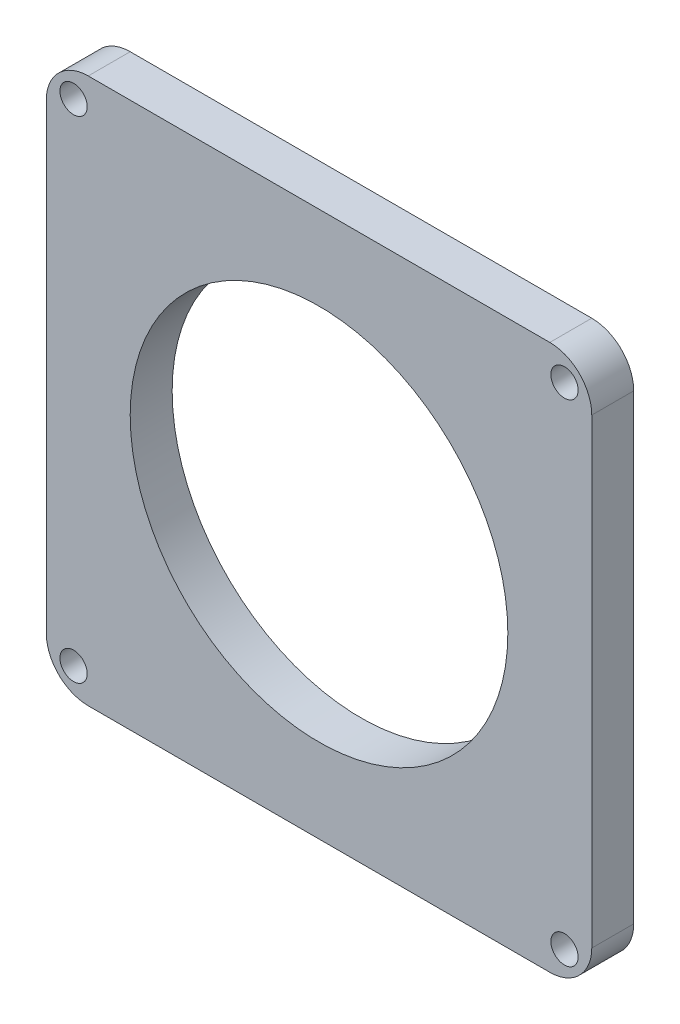
ISO-10303-21;
HEADER;
FILE_DESCRIPTION(('STEP AP214'),'2;1');
FILE_NAME('part.step','',(''),(''),'','','');
FILE_SCHEMA(('AUTOMOTIVE_DESIGN { 1 0 10303 214 1 1 1 1 }'));
ENDSEC;
DATA;
#1=APPLICATION_CONTEXT('core data for automotive mechanical design processes');
#2=APPLICATION_PROTOCOL_DEFINITION('international standard','automotive_design',2000,#1);
#3=PRODUCT_CONTEXT('',#1,'mechanical');
#4=PRODUCT('Part','Part','',(#3));
#5=PRODUCT_RELATED_PRODUCT_CATEGORY('part','',(#4));
#6=PRODUCT_DEFINITION_FORMATION('','',#4);
#7=PRODUCT_DEFINITION_CONTEXT('part definition',#1,'design');
#8=PRODUCT_DEFINITION('design','',#6,#7);
#9=PRODUCT_DEFINITION_SHAPE('','',#8);
#10=(LENGTH_UNIT() NAMED_UNIT(*) SI_UNIT(.MILLI.,.METRE.));
#11=(NAMED_UNIT(*) PLANE_ANGLE_UNIT() SI_UNIT($,.RADIAN.));
#12=(NAMED_UNIT(*) SI_UNIT($,.STERADIAN.) SOLID_ANGLE_UNIT());
#13=UNCERTAINTY_MEASURE_WITH_UNIT(LENGTH_MEASURE(1.E-05),#10,'distance_accuracy_value','');
#14=(GEOMETRIC_REPRESENTATION_CONTEXT(3) GLOBAL_UNCERTAINTY_ASSIGNED_CONTEXT((#13)) GLOBAL_UNIT_ASSIGNED_CONTEXT((#10,
#11,#12)) REPRESENTATION_CONTEXT('',''));
#15=CARTESIAN_POINT('',(0.,0.,0.));
#16=DIRECTION('',(0.,0.,1.));
#17=DIRECTION('',(1.,0.,0.));
#18=AXIS2_PLACEMENT_3D('',#15,#16,#17);
#19=CARTESIAN_POINT('',(-55.,-65.,10.));
#20=DIRECTION('',(0.,0.,1.));
#21=DIRECTION('',(1.,0.,0.));
#22=AXIS2_PLACEMENT_3D('',#19,#20,#21);
#23=PLANE('',#22);
#24=CARTESIAN_POINT('',(0.,0.,10.));
#25=DIRECTION('',(0.,0.,1.));
#26=DIRECTION('',(1.,0.,0.));
#27=AXIS2_PLACEMENT_3D('',#24,#25,#26);
#28=CIRCLE('',#27,45.);
#29=CARTESIAN_POINT('',(45.,0.,10.));
#30=VERTEX_POINT('',#29);
#31=EDGE_CURVE('E38',#30,#30,#28,.T.);
#32=ORIENTED_EDGE('',*,*,#31,.F.);
#33=EDGE_LOOP('',(#32));
#34=FACE_BOUND('',#33,.T.);
#35=CARTESIAN_POINT('',(-58.4999999999984,-58.5000000000001,10.));
#36=DIRECTION('',(0.,0.,1.));
#37=DIRECTION('',(1.,0.,0.));
#38=AXIS2_PLACEMENT_3D('',#35,#36,#37);
#39=CIRCLE('',#38,3.25000000000126);
#40=CARTESIAN_POINT('',(-55.2499999999971,-58.5000000000001,10.));
#41=VERTEX_POINT('',#40);
#42=EDGE_CURVE('E44',#41,#41,#39,.T.);
#43=ORIENTED_EDGE('',*,*,#42,.F.);
#44=EDGE_LOOP('',(#43));
#45=FACE_BOUND('',#44,.T.);
#46=CARTESIAN_POINT('',(58.5000000000017,-58.4999999999984,10.));
#47=DIRECTION('',(0.,0.,1.));
#48=DIRECTION('',(1.,0.,0.));
#49=AXIS2_PLACEMENT_3D('',#46,#47,#48);
#50=CIRCLE('',#49,3.25000000000256);
#51=CARTESIAN_POINT('',(61.7500000000042,-58.4999999999984,10.));
#52=VERTEX_POINT('',#51);
#53=EDGE_CURVE('E161',#52,#52,#50,.T.);
#54=ORIENTED_EDGE('',*,*,#53,.F.);
#55=EDGE_LOOP('',(#54));
#56=FACE_BOUND('',#55,.T.);
#57=CARTESIAN_POINT('',(58.5,58.5000000000016,10.));
#58=DIRECTION('',(0.,0.,1.));
#59=DIRECTION('',(1.,0.,0.));
#60=AXIS2_PLACEMENT_3D('',#57,#58,#59);
#61=CIRCLE('',#60,3.2500000000018);
#62=CARTESIAN_POINT('',(61.7500000000018,58.5000000000016,10.));
#63=VERTEX_POINT('',#62);
#64=EDGE_CURVE('E157',#63,#63,#61,.T.);
#65=ORIENTED_EDGE('',*,*,#64,.F.);
#66=EDGE_LOOP('',(#65));
#67=FACE_BOUND('',#66,.T.);
#68=CARTESIAN_POINT('',(-58.5,58.5,10.));
#69=DIRECTION('',(0.,0.,1.));
#70=DIRECTION('',(1.,0.,0.));
#71=AXIS2_PLACEMENT_3D('',#68,#69,#70);
#72=CIRCLE('',#71,3.25);
#73=CARTESIAN_POINT('',(-55.25,58.5,10.));
#74=VERTEX_POINT('',#73);
#75=EDGE_CURVE('E154',#74,#74,#72,.T.);
#76=ORIENTED_EDGE('',*,*,#75,.F.);
#77=EDGE_LOOP('',(#76));
#78=FACE_BOUND('',#77,.T.);
#79=CARTESIAN_POINT('',(-55.,-55.,10.));
#80=DIRECTION('',(0.,0.,1.));
#81=DIRECTION('',(1.,0.,0.));
#82=AXIS2_PLACEMENT_3D('',#79,#80,#81);
#83=CIRCLE('',#82,9.99999999999998);
#84=CARTESIAN_POINT('',(-65.,-55.,10.));
#85=VERTEX_POINT('',#84);
#86=CARTESIAN_POINT('',(-55.,-65.,10.));
#87=VERTEX_POINT('',#86);
#88=EDGE_CURVE('E152',#85,#87,#83,.T.);
#89=ORIENTED_EDGE('',*,*,#88,.T.);
#90=DIRECTION('',(1.,0.,0.));
#91=VECTOR('',#90,1.);
#92=CARTESIAN_POINT('',(-55.,-65.,10.));
#93=LINE('',#92,#91);
#94=CARTESIAN_POINT('',(55.,-65.,10.));
#95=VERTEX_POINT('',#94);
#96=EDGE_CURVE('E80',#87,#95,#93,.T.);
#97=ORIENTED_EDGE('',*,*,#96,.T.);
#98=CARTESIAN_POINT('',(55.,-55.,10.));
#99=DIRECTION('',(0.,0.,1.));
#100=DIRECTION('',(1.,0.,0.));
#101=AXIS2_PLACEMENT_3D('',#98,#99,#100);
#102=CIRCLE('',#101,10.);
#103=CARTESIAN_POINT('',(65.,-55.,10.));
#104=VERTEX_POINT('',#103);
#105=EDGE_CURVE('E149',#95,#104,#102,.T.);
#106=ORIENTED_EDGE('',*,*,#105,.T.);
#107=DIRECTION('',(0.,1.,0.));
#108=VECTOR('',#107,1.);
#109=CARTESIAN_POINT('',(65.,55.,10.));
#110=LINE('',#109,#108);
#111=CARTESIAN_POINT('',(65.,55.,10.));
#112=VERTEX_POINT('',#111);
#113=EDGE_CURVE('E122',#104,#112,#110,.T.);
#114=ORIENTED_EDGE('',*,*,#113,.T.);
#115=CARTESIAN_POINT('',(55.,55.,10.));
#116=DIRECTION('',(0.,0.,1.));
#117=DIRECTION('',(-1.,0.,0.));
#118=AXIS2_PLACEMENT_3D('',#115,#116,#117);
#119=CIRCLE('',#118,10.);
#120=CARTESIAN_POINT('',(55.,65.,10.));
#121=VERTEX_POINT('',#120);
#122=EDGE_CURVE('E146',#112,#121,#119,.T.);
#123=ORIENTED_EDGE('',*,*,#122,.T.);
#124=DIRECTION('',(-1.,0.,0.));
#125=VECTOR('',#124,1.);
#126=CARTESIAN_POINT('',(-55.,65.,10.));
#127=LINE('',#126,#125);
#128=CARTESIAN_POINT('',(-55.,65.,10.));
#129=VERTEX_POINT('',#128);
#130=EDGE_CURVE('E144',#121,#129,#127,.T.);
#131=ORIENTED_EDGE('',*,*,#130,.T.);
#132=CARTESIAN_POINT('',(-55.,55.,10.));
#133=DIRECTION('',(0.,0.,1.));
#134=DIRECTION('',(1.,0.,0.));
#135=AXIS2_PLACEMENT_3D('',#132,#133,#134);
#136=CIRCLE('',#135,10.);
#137=CARTESIAN_POINT('',(-65.,55.,10.));
#138=VERTEX_POINT('',#137);
#139=EDGE_CURVE('E141',#129,#138,#136,.T.);
#140=ORIENTED_EDGE('',*,*,#139,.T.);
#141=DIRECTION('',(0.,-1.,0.));
#142=VECTOR('',#141,1.);
#143=CARTESIAN_POINT('',(-65.,55.,10.));
#144=LINE('',#143,#142);
#145=EDGE_CURVE('E139',#138,#85,#144,.T.);
#146=ORIENTED_EDGE('',*,*,#145,.T.);
#147=EDGE_LOOP('',(#89,#97,#106,#114,#123,#131,#140,#146));
#148=FACE_BOUND('',#147,.T.);
#149=ADVANCED_FACE('F34',(#34,#45,#56,#67,#78,#148),#23,.T.);
#150=CARTESIAN_POINT('',(-55.,-65.,10.));
#151=DIRECTION('',(0.,1.,0.));
#152=DIRECTION('',(0.,0.,1.));
#153=AXIS2_PLACEMENT_3D('',#150,#151,#152);
#154=PLANE('',#153);
#155=DIRECTION('',(1.,0.,0.));
#156=VECTOR('',#155,1.);
#157=CARTESIAN_POINT('',(-55.,-65.,0.));
#158=LINE('',#157,#156);
#159=CARTESIAN_POINT('',(-55.,-65.,0.));
#160=VERTEX_POINT('',#159);
#161=CARTESIAN_POINT('',(55.,-65.,0.));
#162=VERTEX_POINT('',#161);
#163=EDGE_CURVE('E52',#160,#162,#158,.T.);
#164=ORIENTED_EDGE('',*,*,#163,.T.);
#165=DIRECTION('',(0.,0.,-1.));
#166=VECTOR('',#165,1.);
#167=CARTESIAN_POINT('',(55.,-65.,10.));
#168=LINE('',#167,#166);
#169=EDGE_CURVE('E114',#95,#162,#168,.T.);
#170=ORIENTED_EDGE('',*,*,#169,.F.);
#171=ORIENTED_EDGE('',*,*,#96,.F.);
#172=DIRECTION('',(0.,0.,-1.));
#173=VECTOR('',#172,1.);
#174=CARTESIAN_POINT('',(-55.,-65.,10.));
#175=LINE('',#174,#173);
#176=EDGE_CURVE('E179',#87,#160,#175,.T.);
#177=ORIENTED_EDGE('',*,*,#176,.T.);
#178=EDGE_LOOP('',(#164,#170,#171,#177));
#179=FACE_BOUND('',#178,.T.);
#180=ADVANCED_FACE('F172',(#179),#154,.F.);
#181=CARTESIAN_POINT('',(55.,-55.,10.));
#182=DIRECTION('',(0.,0.,-1.));
#183=DIRECTION('',(-1.,0.,0.));
#184=AXIS2_PLACEMENT_3D('',#181,#182,#183);
#185=CYLINDRICAL_SURFACE('',#184,10.);
#186=CARTESIAN_POINT('',(55.,-55.,0.));
#187=DIRECTION('',(0.,0.,1.));
#188=DIRECTION('',(1.,0.,0.));
#189=AXIS2_PLACEMENT_3D('',#186,#187,#188);
#190=CIRCLE('',#189,10.);
#191=CARTESIAN_POINT('',(65.,-55.,0.));
#192=VERTEX_POINT('',#191);
#193=EDGE_CURVE('E108',#162,#192,#190,.T.);
#194=ORIENTED_EDGE('',*,*,#193,.T.);
#195=DIRECTION('',(0.,0.,-1.));
#196=VECTOR('',#195,1.);
#197=CARTESIAN_POINT('',(65.,-55.,10.));
#198=LINE('',#197,#196);
#199=EDGE_CURVE('E112',#104,#192,#198,.T.);
#200=ORIENTED_EDGE('',*,*,#199,.F.);
#201=ORIENTED_EDGE('',*,*,#105,.F.);
#202=ORIENTED_EDGE('',*,*,#169,.T.);
#203=EDGE_LOOP('',(#194,#200,#201,#202));
#204=FACE_BOUND('',#203,.T.);
#205=ADVANCED_FACE('F110',(#204),#185,.T.);
#206=CARTESIAN_POINT('',(65.,55.,10.));
#207=DIRECTION('',(-1.,0.,0.));
#208=DIRECTION('',(0.,-1.,0.));
#209=AXIS2_PLACEMENT_3D('',#206,#207,#208);
#210=PLANE('',#209);
#211=DIRECTION('',(0.,1.,0.));
#212=VECTOR('',#211,1.);
#213=CARTESIAN_POINT('',(65.,55.,0.));
#214=LINE('',#213,#212);
#215=CARTESIAN_POINT('',(65.,55.,0.));
#216=VERTEX_POINT('',#215);
#217=EDGE_CURVE('E116',#192,#216,#214,.T.);
#218=ORIENTED_EDGE('',*,*,#217,.T.);
#219=DIRECTION('',(0.,0.,-1.));
#220=VECTOR('',#219,1.);
#221=CARTESIAN_POINT('',(65.,55.,10.));
#222=LINE('',#221,#220);
#223=EDGE_CURVE('E123',#112,#216,#222,.T.);
#224=ORIENTED_EDGE('',*,*,#223,.F.);
#225=ORIENTED_EDGE('',*,*,#113,.F.);
#226=ORIENTED_EDGE('',*,*,#199,.T.);
#227=EDGE_LOOP('',(#218,#224,#225,#226));
#228=FACE_BOUND('',#227,.T.);
#229=ADVANCED_FACE('F119',(#228),#210,.F.);
#230=CARTESIAN_POINT('',(55.,55.,10.));
#231=DIRECTION('',(0.,0.,-1.));
#232=DIRECTION('',(-1.,0.,0.));
#233=AXIS2_PLACEMENT_3D('',#230,#231,#232);
#234=CYLINDRICAL_SURFACE('',#233,10.);
#235=CARTESIAN_POINT('',(55.,55.,0.));
#236=DIRECTION('',(0.,0.,1.));
#237=DIRECTION('',(-1.,0.,0.));
#238=AXIS2_PLACEMENT_3D('',#235,#236,#237);
#239=CIRCLE('',#238,10.);
#240=CARTESIAN_POINT('',(55.,65.,0.));
#241=VERTEX_POINT('',#240);
#242=EDGE_CURVE('E128',#216,#241,#239,.T.);
#243=ORIENTED_EDGE('',*,*,#242,.T.);
#244=DIRECTION('',(0.,0.,-1.));
#245=VECTOR('',#244,1.);
#246=CARTESIAN_POINT('',(55.,65.,10.));
#247=LINE('',#246,#245);
#248=EDGE_CURVE('E188',#121,#241,#247,.T.);
#249=ORIENTED_EDGE('',*,*,#248,.F.);
#250=ORIENTED_EDGE('',*,*,#122,.F.);
#251=ORIENTED_EDGE('',*,*,#223,.T.);
#252=EDGE_LOOP('',(#243,#249,#250,#251));
#253=FACE_BOUND('',#252,.T.);
#254=ADVANCED_FACE('F211',(#253),#234,.T.);
#255=CARTESIAN_POINT('',(-55.,65.,10.));
#256=DIRECTION('',(0.,-1.,0.));
#257=DIRECTION('',(0.,0.,-1.));
#258=AXIS2_PLACEMENT_3D('',#255,#256,#257);
#259=PLANE('',#258);
#260=DIRECTION('',(-1.,0.,0.));
#261=VECTOR('',#260,1.);
#262=CARTESIAN_POINT('',(-55.,65.,0.));
#263=LINE('',#262,#261);
#264=CARTESIAN_POINT('',(-55.,65.,0.));
#265=VERTEX_POINT('',#264);
#266=EDGE_CURVE('E130',#241,#265,#263,.T.);
#267=ORIENTED_EDGE('',*,*,#266,.T.);
#268=DIRECTION('',(0.,0.,-1.));
#269=VECTOR('',#268,1.);
#270=CARTESIAN_POINT('',(-55.,65.,10.));
#271=LINE('',#270,#269);
#272=EDGE_CURVE('E191',#129,#265,#271,.T.);
#273=ORIENTED_EDGE('',*,*,#272,.F.);
#274=ORIENTED_EDGE('',*,*,#130,.F.);
#275=ORIENTED_EDGE('',*,*,#248,.T.);
#276=EDGE_LOOP('',(#267,#273,#274,#275));
#277=FACE_BOUND('',#276,.T.);
#278=ADVANCED_FACE('F201',(#277),#259,.F.);
#279=CARTESIAN_POINT('',(-55.,55.,10.));
#280=DIRECTION('',(0.,0.,-1.));
#281=DIRECTION('',(-1.,0.,0.));
#282=AXIS2_PLACEMENT_3D('',#279,#280,#281);
#283=CYLINDRICAL_SURFACE('',#282,10.);
#284=CARTESIAN_POINT('',(-55.,55.,0.));
#285=DIRECTION('',(0.,0.,1.));
#286=DIRECTION('',(1.,0.,0.));
#287=AXIS2_PLACEMENT_3D('',#284,#285,#286);
#288=CIRCLE('',#287,10.);
#289=CARTESIAN_POINT('',(-65.,55.,0.));
#290=VERTEX_POINT('',#289);
#291=EDGE_CURVE('E198',#265,#290,#288,.T.);
#292=ORIENTED_EDGE('',*,*,#291,.T.);
#293=DIRECTION('',(0.,0.,-1.));
#294=VECTOR('',#293,1.);
#295=CARTESIAN_POINT('',(-65.,55.,10.));
#296=LINE('',#295,#294);
#297=EDGE_CURVE('E194',#138,#290,#296,.T.);
#298=ORIENTED_EDGE('',*,*,#297,.F.);
#299=ORIENTED_EDGE('',*,*,#139,.F.);
#300=ORIENTED_EDGE('',*,*,#272,.T.);
#301=EDGE_LOOP('',(#292,#298,#299,#300));
#302=FACE_BOUND('',#301,.T.);
#303=ADVANCED_FACE('F207',(#302),#283,.T.);
#304=CARTESIAN_POINT('',(-55.,-55.,10.));
#305=DIRECTION('',(0.,0.,-1.));
#306=DIRECTION('',(-1.,0.,0.));
#307=AXIS2_PLACEMENT_3D('',#304,#305,#306);
#308=CYLINDRICAL_SURFACE('',#307,9.99999999999998);
#309=CARTESIAN_POINT('',(-55.,-55.,0.));
#310=DIRECTION('',(0.,0.,1.));
#311=DIRECTION('',(1.,0.,0.));
#312=AXIS2_PLACEMENT_3D('',#309,#310,#311);
#313=CIRCLE('',#312,9.99999999999998);
#314=CARTESIAN_POINT('',(-65.,-55.,0.));
#315=VERTEX_POINT('',#314);
#316=EDGE_CURVE('E135',#315,#160,#313,.T.);
#317=ORIENTED_EDGE('',*,*,#316,.T.);
#318=ORIENTED_EDGE('',*,*,#176,.F.);
#319=ORIENTED_EDGE('',*,*,#88,.F.);
#320=DIRECTION('',(0.,0.,-1.));
#321=VECTOR('',#320,1.);
#322=CARTESIAN_POINT('',(-65.,-55.,10.));
#323=LINE('',#322,#321);
#324=EDGE_CURVE('E142',#85,#315,#323,.T.);
#325=ORIENTED_EDGE('',*,*,#324,.T.);
#326=EDGE_LOOP('',(#317,#318,#319,#325));
#327=FACE_BOUND('',#326,.T.);
#328=ADVANCED_FACE('F180',(#327),#308,.T.);
#329=CARTESIAN_POINT('',(-55.,-55.,0.));
#330=DIRECTION('',(0.,0.,1.));
#331=DIRECTION('',(1.,0.,0.));
#332=AXIS2_PLACEMENT_3D('',#329,#330,#331);
#333=PLANE('',#332);
#334=CARTESIAN_POINT('',(0.,0.,0.));
#335=DIRECTION('',(0.,0.,1.));
#336=DIRECTION('',(1.,0.,0.));
#337=AXIS2_PLACEMENT_3D('',#334,#335,#336);
#338=CIRCLE('',#337,45.);
#339=CARTESIAN_POINT('',(45.,0.,0.));
#340=VERTEX_POINT('',#339);
#341=EDGE_CURVE('E11',#340,#340,#338,.T.);
#342=ORIENTED_EDGE('',*,*,#341,.T.);
#343=EDGE_LOOP('',(#342));
#344=FACE_BOUND('',#343,.T.);
#345=CARTESIAN_POINT('',(-58.4999999999984,-58.5000000000001,0.));
#346=DIRECTION('',(0.,0.,1.));
#347=DIRECTION('',(1.,0.,0.));
#348=AXIS2_PLACEMENT_3D('',#345,#346,#347);
#349=CIRCLE('',#348,3.25000000000126);
#350=CARTESIAN_POINT('',(-55.2499999999971,-58.5000000000001,0.));
#351=VERTEX_POINT('',#350);
#352=EDGE_CURVE('E138',#351,#351,#349,.T.);
#353=ORIENTED_EDGE('',*,*,#352,.T.);
#354=EDGE_LOOP('',(#353));
#355=FACE_BOUND('',#354,.T.);
#356=CARTESIAN_POINT('',(58.5000000000017,-58.4999999999984,0.));
#357=DIRECTION('',(0.,0.,1.));
#358=DIRECTION('',(1.,0.,0.));
#359=AXIS2_PLACEMENT_3D('',#356,#357,#358);
#360=CIRCLE('',#359,3.25000000000256);
#361=CARTESIAN_POINT('',(61.7500000000042,-58.4999999999984,0.));
#362=VERTEX_POINT('',#361);
#363=EDGE_CURVE('E366',#362,#362,#360,.T.);
#364=ORIENTED_EDGE('',*,*,#363,.T.);
#365=EDGE_LOOP('',(#364));
#366=FACE_BOUND('',#365,.T.);
#367=CARTESIAN_POINT('',(58.5,58.5000000000016,0.));
#368=DIRECTION('',(0.,0.,1.));
#369=DIRECTION('',(1.,0.,0.));
#370=AXIS2_PLACEMENT_3D('',#367,#368,#369);
#371=CIRCLE('',#370,3.2500000000018);
#372=CARTESIAN_POINT('',(61.7500000000018,58.5000000000016,0.));
#373=VERTEX_POINT('',#372);
#374=EDGE_CURVE('E368',#373,#373,#371,.T.);
#375=ORIENTED_EDGE('',*,*,#374,.T.);
#376=EDGE_LOOP('',(#375));
#377=FACE_BOUND('',#376,.T.);
#378=CARTESIAN_POINT('',(-58.5,58.5,0.));
#379=DIRECTION('',(0.,0.,1.));
#380=DIRECTION('',(1.,0.,0.));
#381=AXIS2_PLACEMENT_3D('',#378,#379,#380);
#382=CIRCLE('',#381,3.25);
#383=CARTESIAN_POINT('',(-55.25,58.5,0.));
#384=VERTEX_POINT('',#383);
#385=EDGE_CURVE('E158',#384,#384,#382,.T.);
#386=ORIENTED_EDGE('',*,*,#385,.T.);
#387=EDGE_LOOP('',(#386));
#388=FACE_BOUND('',#387,.T.);
#389=ORIENTED_EDGE('',*,*,#316,.F.);
#390=DIRECTION('',(0.,-1.,0.));
#391=VECTOR('',#390,1.);
#392=CARTESIAN_POINT('',(-65.,55.,0.));
#393=LINE('',#392,#391);
#394=EDGE_CURVE('E91',#290,#315,#393,.T.);
#395=ORIENTED_EDGE('',*,*,#394,.F.);
#396=ORIENTED_EDGE('',*,*,#291,.F.);
#397=ORIENTED_EDGE('',*,*,#266,.F.);
#398=ORIENTED_EDGE('',*,*,#242,.F.);
#399=ORIENTED_EDGE('',*,*,#217,.F.);
#400=ORIENTED_EDGE('',*,*,#193,.F.);
#401=ORIENTED_EDGE('',*,*,#163,.F.);
#402=EDGE_LOOP('',(#389,#395,#396,#397,#398,#399,#400,#401));
#403=FACE_BOUND('',#402,.T.);
#404=ADVANCED_FACE('F126',(#344,#355,#366,#377,#388,#403),#333,.F.);
#405=CARTESIAN_POINT('',(-58.4999999999984,-58.5000000000001,-45.));
#406=DIRECTION('',(0.,0.,1.));
#407=DIRECTION('',(1.,0.,0.));
#408=AXIS2_PLACEMENT_3D('',#405,#406,#407);
#409=CYLINDRICAL_SURFACE('',#408,3.25000000000126);
#410=ORIENTED_EDGE('',*,*,#42,.T.);
#411=EDGE_LOOP('',(#410));
#412=FACE_BOUND('',#411,.T.);
#413=ORIENTED_EDGE('',*,*,#352,.F.);
#414=EDGE_LOOP('',(#413));
#415=FACE_BOUND('',#414,.T.);
#416=ADVANCED_FACE('F232',(#412,#415),#409,.F.);
#417=CARTESIAN_POINT('',(58.5000000000017,-58.4999999999984,-45.));
#418=DIRECTION('',(0.,0.,1.));
#419=DIRECTION('',(1.,0.,0.));
#420=AXIS2_PLACEMENT_3D('',#417,#418,#419);
#421=CYLINDRICAL_SURFACE('',#420,3.25000000000256);
#422=ORIENTED_EDGE('',*,*,#53,.T.);
#423=EDGE_LOOP('',(#422));
#424=FACE_BOUND('',#423,.T.);
#425=ORIENTED_EDGE('',*,*,#363,.F.);
#426=EDGE_LOOP('',(#425));
#427=FACE_BOUND('',#426,.T.);
#428=ADVANCED_FACE('F248',(#424,#427),#421,.F.);
#429=CARTESIAN_POINT('',(58.5,58.5000000000016,-45.));
#430=DIRECTION('',(0.,0.,1.));
#431=DIRECTION('',(1.,0.,0.));
#432=AXIS2_PLACEMENT_3D('',#429,#430,#431);
#433=CYLINDRICAL_SURFACE('',#432,3.2500000000018);
#434=ORIENTED_EDGE('',*,*,#64,.T.);
#435=EDGE_LOOP('',(#434));
#436=FACE_BOUND('',#435,.T.);
#437=ORIENTED_EDGE('',*,*,#374,.F.);
#438=EDGE_LOOP('',(#437));
#439=FACE_BOUND('',#438,.T.);
#440=ADVANCED_FACE('F167',(#436,#439),#433,.F.);
#441=CARTESIAN_POINT('',(-58.5,58.5,-45.));
#442=DIRECTION('',(0.,0.,1.));
#443=DIRECTION('',(1.,0.,0.));
#444=AXIS2_PLACEMENT_3D('',#441,#442,#443);
#445=CYLINDRICAL_SURFACE('',#444,3.25);
#446=ORIENTED_EDGE('',*,*,#75,.T.);
#447=EDGE_LOOP('',(#446));
#448=FACE_BOUND('',#447,.T.);
#449=ORIENTED_EDGE('',*,*,#385,.F.);
#450=EDGE_LOOP('',(#449));
#451=FACE_BOUND('',#450,.T.);
#452=ADVANCED_FACE('F241',(#448,#451),#445,.F.);
#453=CARTESIAN_POINT('',(-65.,55.,10.));
#454=DIRECTION('',(1.,0.,0.));
#455=DIRECTION('',(0.,1.,0.));
#456=AXIS2_PLACEMENT_3D('',#453,#454,#455);
#457=PLANE('',#456);
#458=ORIENTED_EDGE('',*,*,#394,.T.);
#459=ORIENTED_EDGE('',*,*,#324,.F.);
#460=ORIENTED_EDGE('',*,*,#145,.F.);
#461=ORIENTED_EDGE('',*,*,#297,.T.);
#462=EDGE_LOOP('',(#458,#459,#460,#461));
#463=FACE_BOUND('',#462,.T.);
#464=ADVANCED_FACE('F239',(#463),#457,.F.);
#465=CARTESIAN_POINT('',(0.,0.,65.05));
#466=DIRECTION('',(0.,0.,-1.));
#467=DIRECTION('',(-1.,0.,0.));
#468=AXIS2_PLACEMENT_3D('',#465,#466,#467);
#469=CYLINDRICAL_SURFACE('',#468,45.);
#470=ORIENTED_EDGE('',*,*,#341,.F.);
#471=EDGE_LOOP('',(#470));
#472=FACE_BOUND('',#471,.T.);
#473=ORIENTED_EDGE('',*,*,#31,.T.);
#474=EDGE_LOOP('',(#473));
#475=FACE_BOUND('',#474,.T.);
#476=ADVANCED_FACE('F36',(#472,#475),#469,.F.);
#477=CLOSED_SHELL('',(#149,#180,#205,#229,#254,#278,#303,#328,#404,#416,#428,#440,#452,#464,#476));
#478=MANIFOLD_SOLID_BREP('B2',#477);
#479=ADVANCED_BREP_SHAPE_REPRESENTATION('',(#18,#478),#14);
#480=SHAPE_DEFINITION_REPRESENTATION(#9,#479);
ENDSEC;
END-ISO-10303-21;
